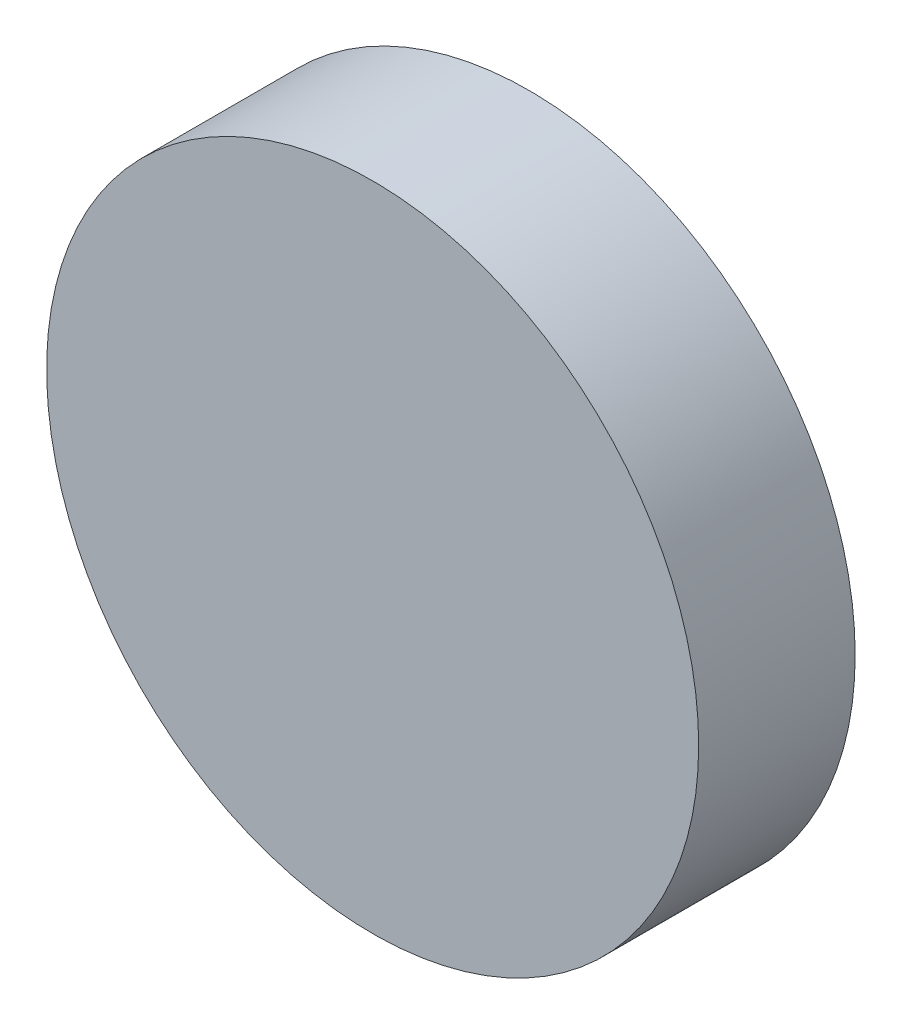
ISO-10303-21;
HEADER;
FILE_DESCRIPTION(('STEP AP214'),'2;1');
FILE_NAME('part.step','',(''),(''),'','','');
FILE_SCHEMA(('AUTOMOTIVE_DESIGN { 1 0 10303 214 1 1 1 1 }'));
ENDSEC;
DATA;
#1=APPLICATION_CONTEXT('core data for automotive mechanical design processes');
#2=APPLICATION_PROTOCOL_DEFINITION('international standard','automotive_design',2000,#1);
#3=PRODUCT_CONTEXT('',#1,'mechanical');
#4=PRODUCT('Part','Part','',(#3));
#5=PRODUCT_RELATED_PRODUCT_CATEGORY('part','',(#4));
#6=PRODUCT_DEFINITION_FORMATION('','',#4);
#7=PRODUCT_DEFINITION_CONTEXT('part definition',#1,'design');
#8=PRODUCT_DEFINITION('design','',#6,#7);
#9=PRODUCT_DEFINITION_SHAPE('','',#8);
#10=(LENGTH_UNIT() NAMED_UNIT(*) SI_UNIT(.MILLI.,.METRE.));
#11=(NAMED_UNIT(*) PLANE_ANGLE_UNIT() SI_UNIT($,.RADIAN.));
#12=(NAMED_UNIT(*) SI_UNIT($,.STERADIAN.) SOLID_ANGLE_UNIT());
#13=UNCERTAINTY_MEASURE_WITH_UNIT(LENGTH_MEASURE(1.E-05),#10,'distance_accuracy_value','');
#14=(GEOMETRIC_REPRESENTATION_CONTEXT(3) GLOBAL_UNCERTAINTY_ASSIGNED_CONTEXT((#13)) GLOBAL_UNIT_ASSIGNED_CONTEXT((#10,
#11,#12)) REPRESENTATION_CONTEXT('',''));
#15=CARTESIAN_POINT('',(0.,0.,0.));
#16=DIRECTION('',(0.,0.,1.));
#17=DIRECTION('',(1.,0.,0.));
#18=AXIS2_PLACEMENT_3D('',#15,#16,#17);
#19=CARTESIAN_POINT('',(0.,0.,3.));
#20=DIRECTION('',(0.,0.,-1.));
#21=DIRECTION('',(-1.,0.,0.));
#22=AXIS2_PLACEMENT_3D('',#19,#20,#21);
#23=CYLINDRICAL_SURFACE('',#22,6.25);
#24=CARTESIAN_POINT('',(0.,0.,3.));
#25=DIRECTION('',(0.,0.,1.));
#26=DIRECTION('',(1.,0.,0.));
#27=AXIS2_PLACEMENT_3D('',#24,#25,#26);
#28=CIRCLE('',#27,6.25);
#29=CARTESIAN_POINT('',(6.25,0.,3.));
#30=VERTEX_POINT('',#29);
#31=EDGE_CURVE('E10',#30,#30,#28,.T.);
#32=ORIENTED_EDGE('',*,*,#31,.F.);
#33=EDGE_LOOP('',(#32));
#34=FACE_BOUND('',#33,.T.);
#35=CARTESIAN_POINT('',(0.,0.,0.));
#36=DIRECTION('',(0.,0.,1.));
#37=DIRECTION('',(1.,0.,0.));
#38=AXIS2_PLACEMENT_3D('',#35,#36,#37);
#39=CIRCLE('',#38,6.25);
#40=CARTESIAN_POINT('',(6.25,0.,0.));
#41=VERTEX_POINT('',#40);
#42=EDGE_CURVE('E41',#41,#41,#39,.T.);
#43=ORIENTED_EDGE('',*,*,#42,.T.);
#44=EDGE_LOOP('',(#43));
#45=FACE_BOUND('',#44,.T.);
#46=ADVANCED_FACE('F38',(#34,#45),#23,.T.);
#47=CARTESIAN_POINT('',(0.,0.,3.));
#48=DIRECTION('',(0.,0.,1.));
#49=DIRECTION('',(1.,0.,0.));
#50=AXIS2_PLACEMENT_3D('',#47,#48,#49);
#51=PLANE('',#50);
#52=ORIENTED_EDGE('',*,*,#31,.T.);
#53=EDGE_LOOP('',(#52));
#54=FACE_BOUND('',#53,.T.);
#55=ADVANCED_FACE('F55',(#54),#51,.T.);
#56=CARTESIAN_POINT('',(0.,0.,0.));
#57=DIRECTION('',(0.,0.,1.));
#58=DIRECTION('',(1.,0.,0.));
#59=AXIS2_PLACEMENT_3D('',#56,#57,#58);
#60=PLANE('',#59);
#61=ORIENTED_EDGE('',*,*,#42,.F.);
#62=EDGE_LOOP('',(#61));
#63=FACE_BOUND('',#62,.T.);
#64=ADVANCED_FACE('F53',(#63),#60,.F.);
#65=CLOSED_SHELL('',(#46,#55,#64));
#66=MANIFOLD_SOLID_BREP('B2',#65);
#67=ADVANCED_BREP_SHAPE_REPRESENTATION('',(#18,#66),#14);
#68=SHAPE_DEFINITION_REPRESENTATION(#9,#67);
ENDSEC;
END-ISO-10303-21;
